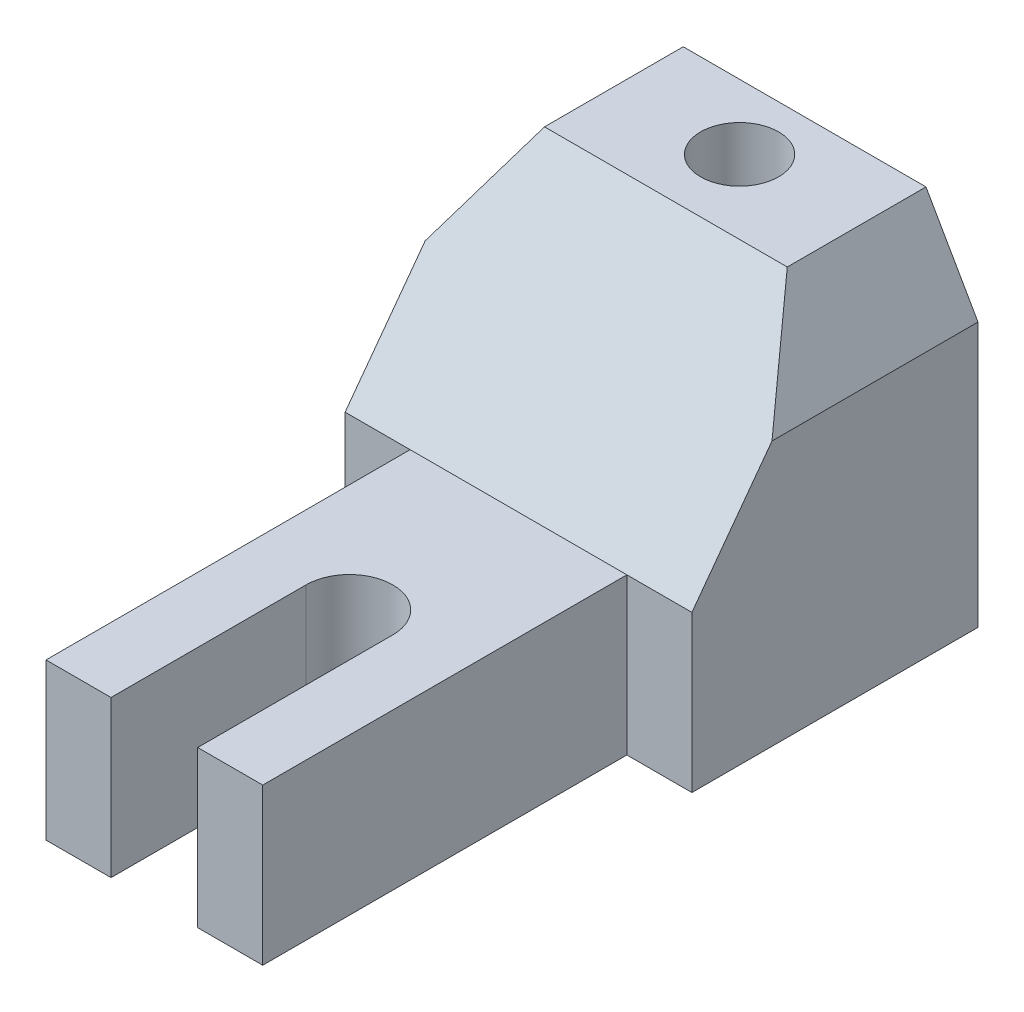
ISO-10303-21;
HEADER;
FILE_DESCRIPTION(('STEP AP214'),'2;1');
FILE_NAME('part.step','',(''),(''),'','','');
FILE_SCHEMA(('AUTOMOTIVE_DESIGN { 1 0 10303 214 1 1 1 1 }'));
ENDSEC;
DATA;
#1=APPLICATION_CONTEXT('core data for automotive mechanical design processes');
#2=APPLICATION_PROTOCOL_DEFINITION('international standard','automotive_design',2000,#1);
#3=PRODUCT_CONTEXT('',#1,'mechanical');
#4=PRODUCT('Part','Part','',(#3));
#5=PRODUCT_RELATED_PRODUCT_CATEGORY('part','',(#4));
#6=PRODUCT_DEFINITION_FORMATION('','',#4);
#7=PRODUCT_DEFINITION_CONTEXT('part definition',#1,'design');
#8=PRODUCT_DEFINITION('design','',#6,#7);
#9=PRODUCT_DEFINITION_SHAPE('','',#8);
#10=(LENGTH_UNIT() NAMED_UNIT(*) SI_UNIT(.MILLI.,.METRE.));
#11=(NAMED_UNIT(*) PLANE_ANGLE_UNIT() SI_UNIT($,.RADIAN.));
#12=(NAMED_UNIT(*) SI_UNIT($,.STERADIAN.) SOLID_ANGLE_UNIT());
#13=UNCERTAINTY_MEASURE_WITH_UNIT(LENGTH_MEASURE(1.E-05),#10,'distance_accuracy_value','');
#14=(GEOMETRIC_REPRESENTATION_CONTEXT(3) GLOBAL_UNCERTAINTY_ASSIGNED_CONTEXT((#13)) GLOBAL_UNIT_ASSIGNED_CONTEXT((#10,
#11,#12)) REPRESENTATION_CONTEXT('',''));
#15=CARTESIAN_POINT('',(0.,0.,0.));
#16=DIRECTION('',(0.,0.,1.));
#17=DIRECTION('',(1.,0.,0.));
#18=AXIS2_PLACEMENT_3D('',#15,#16,#17);
#19=CARTESIAN_POINT('',(18.7623762376237,82.,27.6608910891089));
#20=DIRECTION('',(1.,0.,0.));
#21=DIRECTION('',(0.,0.,-1.));
#22=AXIS2_PLACEMENT_3D('',#19,#20,#21);
#23=PLANE('',#22);
#24=DIRECTION('',(0.,1.,0.));
#25=VECTOR('',#24,1.);
#26=CARTESIAN_POINT('',(18.7623762376237,-68.,-56.3391089108911));
#27=LINE('',#26,#25);
#28=CARTESIAN_POINT('',(18.7623762376237,0.,-56.3391089108911));
#29=VERTEX_POINT('',#28);
#30=CARTESIAN_POINT('',(18.7623762376237,36.,-56.3391089108911));
#31=VERTEX_POINT('',#30);
#32=EDGE_CURVE('E211',#29,#31,#27,.T.);
#33=ORIENTED_EDGE('',*,*,#32,.T.);
#34=DIRECTION('',(0.,0.804176141466326,-0.594391061083806));
#35=VECTOR('',#34,1.);
#36=CARTESIAN_POINT('',(18.7623762376237,36.,-56.3391089108911));
#37=LINE('',#36,#35);
#38=CARTESIAN_POINT('',(18.7623762376237,61.,-74.8173697804563));
#39=VERTEX_POINT('',#38);
#40=EDGE_CURVE('E193',#31,#39,#37,.T.);
#41=ORIENTED_EDGE('',*,*,#40,.T.);
#42=DIRECTION('',(0.,0.,-1.));
#43=VECTOR('',#42,1.);
#44=CARTESIAN_POINT('',(18.7623762376237,61.,27.6608910891089));
#45=LINE('',#44,#43);
#46=CARTESIAN_POINT('',(18.7623762376237,61.,-122.339108910891));
#47=VERTEX_POINT('',#46);
#48=EDGE_CURVE('E255',#39,#47,#45,.T.);
#49=ORIENTED_EDGE('',*,*,#48,.T.);
#50=DIRECTION('',(0.,-1.,0.));
#51=VECTOR('',#50,1.);
#52=CARTESIAN_POINT('',(18.7623762376237,82.,-122.339108910891));
#53=LINE('',#52,#51);
#54=CARTESIAN_POINT('',(18.7623762376237,0.,-122.339108910891));
#55=VERTEX_POINT('',#54);
#56=EDGE_CURVE('E274',#47,#55,#53,.T.);
#57=ORIENTED_EDGE('',*,*,#56,.T.);
#58=DIRECTION('',(0.,0.,1.));
#59=VECTOR('',#58,1.);
#60=CARTESIAN_POINT('',(18.7623762376237,0.,27.6608910891089));
#61=LINE('',#60,#59);
#62=EDGE_CURVE('E222',#55,#29,#61,.T.);
#63=ORIENTED_EDGE('',*,*,#62,.T.);
#64=EDGE_LOOP('',(#33,#41,#49,#57,#63));
#65=FACE_BOUND('',#64,.T.);
#66=ADVANCED_FACE('F87',(#65),#23,.F.);
#67=CARTESIAN_POINT('',(18.7623762376237,82.,27.6608910891089));
#68=DIRECTION('',(0.,0.,-1.));
#69=DIRECTION('',(-1.,0.,0.));
#70=AXIS2_PLACEMENT_3D('',#67,#68,#69);
#71=PLANE('',#70);
#72=DIRECTION('',(0.,1.,0.));
#73=VECTOR('',#72,1.);
#74=CARTESIAN_POINT('',(83.7623762376238,-68.,27.6608910891089));
#75=LINE('',#74,#73);
#76=CARTESIAN_POINT('',(83.7623762376238,0.,27.6608910891089));
#77=VERTEX_POINT('',#76);
#78=CARTESIAN_POINT('',(83.7623762376238,36.,27.6608910891089));
#79=VERTEX_POINT('',#78);
#80=EDGE_CURVE('E238',#77,#79,#75,.T.);
#81=ORIENTED_EDGE('',*,*,#80,.T.);
#82=DIRECTION('',(1.,0.,0.));
#83=VECTOR('',#82,1.);
#84=CARTESIAN_POINT('',(18.7623762376237,36.,27.6608910891089));
#85=LINE('',#84,#83);
#86=CARTESIAN_POINT('',(68.7623762376237,36.,27.6608910891089));
#87=VERTEX_POINT('',#86);
#88=EDGE_CURVE('E205',#87,#79,#85,.T.);
#89=ORIENTED_EDGE('',*,*,#88,.F.);
#90=DIRECTION('',(0.,1.,0.));
#91=VECTOR('',#90,1.);
#92=CARTESIAN_POINT('',(68.7623762376237,-68.,27.6608910891089));
#93=LINE('',#92,#91);
#94=CARTESIAN_POINT('',(68.7623762376237,0.,27.6608910891089));
#95=VERTEX_POINT('',#94);
#96=EDGE_CURVE('E332',#95,#87,#93,.T.);
#97=ORIENTED_EDGE('',*,*,#96,.F.);
#98=DIRECTION('',(1.,0.,0.));
#99=VECTOR('',#98,1.);
#100=CARTESIAN_POINT('',(18.7623762376237,0.,27.6608910891089));
#101=LINE('',#100,#99);
#102=EDGE_CURVE('E278',#95,#77,#101,.T.);
#103=ORIENTED_EDGE('',*,*,#102,.T.);
#104=EDGE_LOOP('',(#81,#89,#97,#103));
#105=FACE_BOUND('',#104,.T.);
#106=ADVANCED_FACE('F329',(#105),#71,.F.);
#107=DIRECTION('',(0.,1.,0.));
#108=VECTOR('',#107,1.);
#109=CARTESIAN_POINT('',(48.7623762376237,-68.,27.6608910891089));
#110=LINE('',#109,#108);
#111=CARTESIAN_POINT('',(48.7623762376237,0.,27.6608910891089));
#112=VERTEX_POINT('',#111);
#113=CARTESIAN_POINT('',(48.7623762376237,36.,27.6608910891089));
#114=VERTEX_POINT('',#113);
#115=EDGE_CURVE('E336',#112,#114,#110,.T.);
#116=ORIENTED_EDGE('',*,*,#115,.T.);
#117=CARTESIAN_POINT('',(33.7623762376237,36.,27.6608910891089));
#118=VERTEX_POINT('',#117);
#119=EDGE_CURVE('E372',#118,#114,#85,.T.);
#120=ORIENTED_EDGE('',*,*,#119,.F.);
#121=DIRECTION('',(0.,1.,0.));
#122=VECTOR('',#121,1.);
#123=CARTESIAN_POINT('',(33.7623762376237,-68.,27.6608910891089));
#124=LINE('',#123,#122);
#125=CARTESIAN_POINT('',(33.7623762376237,0.,27.6608910891089));
#126=VERTEX_POINT('',#125);
#127=EDGE_CURVE('E228',#126,#118,#124,.T.);
#128=ORIENTED_EDGE('',*,*,#127,.F.);
#129=EDGE_CURVE('E282',#126,#112,#101,.T.);
#130=ORIENTED_EDGE('',*,*,#129,.T.);
#131=EDGE_LOOP('',(#116,#120,#128,#130));
#132=FACE_BOUND('',#131,.T.);
#133=ADVANCED_FACE('F402',(#132),#71,.F.);
#134=CARTESIAN_POINT('',(0.,82.,0.));
#135=DIRECTION('',(0.,-1.,0.));
#136=DIRECTION('',(0.,0.,-1.));
#137=AXIS2_PLACEMENT_3D('',#134,#135,#136);
#138=PLANE('',#137);
#139=CARTESIAN_POINT('',(58.7623762376237,82.,-107.339108910891));
#140=DIRECTION('',(0.,1.,0.));
#141=DIRECTION('',(0.,0.,1.));
#142=AXIS2_PLACEMENT_3D('',#139,#140,#141);
#143=CIRCLE('',#142,9.00000000000001);
#144=CARTESIAN_POINT('',(58.7623762376237,82.,-98.3391089108911));
#145=VERTEX_POINT('',#144);
#146=EDGE_CURVE('E246',#145,#145,#143,.T.);
#147=ORIENTED_EDGE('',*,*,#146,.F.);
#148=EDGE_LOOP('',(#147));
#149=FACE_BOUND('',#148,.T.);
#150=DIRECTION('',(0.,0.,-1.));
#151=VECTOR('',#150,1.);
#152=CARTESIAN_POINT('',(30.7623762376237,82.,27.6608910891089));
#153=LINE('',#152,#151);
#154=CARTESIAN_POINT('',(30.7623762376237,82.,-90.3391089108911));
#155=VERTEX_POINT('',#154);
#156=CARTESIAN_POINT('',(30.7623762376237,82.,-122.339108910891));
#157=VERTEX_POINT('',#156);
#158=EDGE_CURVE('E265',#155,#157,#153,.T.);
#159=ORIENTED_EDGE('',*,*,#158,.F.);
#160=DIRECTION('',(1.,0.,0.));
#161=VECTOR('',#160,1.);
#162=CARTESIAN_POINT('',(18.7623762376237,82.,-90.3391089108911));
#163=LINE('',#162,#161);
#164=CARTESIAN_POINT('',(86.7623762376237,82.,-90.3391089108911));
#165=VERTEX_POINT('',#164);
#166=EDGE_CURVE('E216',#155,#165,#163,.T.);
#167=ORIENTED_EDGE('',*,*,#166,.T.);
#168=DIRECTION('',(0.,0.,-1.));
#169=VECTOR('',#168,1.);
#170=CARTESIAN_POINT('',(86.7623762376237,82.,27.6608910891089));
#171=LINE('',#170,#169);
#172=CARTESIAN_POINT('',(86.7623762376237,82.,-122.339108910891));
#173=VERTEX_POINT('',#172);
#174=EDGE_CURVE('E256',#165,#173,#171,.T.);
#175=ORIENTED_EDGE('',*,*,#174,.T.);
#176=DIRECTION('',(-1.,0.,0.));
#177=VECTOR('',#176,1.);
#178=CARTESIAN_POINT('',(18.7623762376237,82.,-122.339108910891));
#179=LINE('',#178,#177);
#180=EDGE_CURVE('E270',#173,#157,#179,.T.);
#181=ORIENTED_EDGE('',*,*,#180,.T.);
#182=EDGE_LOOP('',(#159,#167,#175,#181));
#183=FACE_BOUND('',#182,.T.);
#184=ADVANCED_FACE('F321',(#149,#183),#138,.F.);
#185=CARTESIAN_POINT('',(0.,0.,0.));
#186=DIRECTION('',(0.,-1.,0.));
#187=DIRECTION('',(0.,0.,-1.));
#188=AXIS2_PLACEMENT_3D('',#185,#186,#187);
#189=PLANE('',#188);
#190=CARTESIAN_POINT('',(58.7623762376237,0.,-107.339108910891));
#191=DIRECTION('',(0.,-1.,0.));
#192=DIRECTION('',(0.,0.,-1.));
#193=AXIS2_PLACEMENT_3D('',#190,#191,#192);
#194=CIRCLE('',#193,9.00000000000001);
#195=CARTESIAN_POINT('',(58.7623762376237,0.,-116.339108910891));
#196=VERTEX_POINT('',#195);
#197=EDGE_CURVE('E249',#196,#196,#194,.T.);
#198=ORIENTED_EDGE('',*,*,#197,.F.);
#199=EDGE_LOOP('',(#198));
#200=FACE_BOUND('',#199,.T.);
#201=ORIENTED_EDGE('',*,*,#102,.F.);
#202=DIRECTION('',(0.,0.,-1.));
#203=VECTOR('',#202,1.);
#204=CARTESIAN_POINT('',(68.7623762376237,0.,0.));
#205=LINE('',#204,#203);
#206=CARTESIAN_POINT('',(68.7623762376237,0.,-17.3391089108911));
#207=VERTEX_POINT('',#206);
#208=EDGE_CURVE('E95',#95,#207,#205,.T.);
#209=ORIENTED_EDGE('',*,*,#208,.T.);
#210=CARTESIAN_POINT('',(58.7623762376237,0.,-17.3391089108911));
#211=DIRECTION('',(0.,-1.,0.));
#212=DIRECTION('',(0.,0.,-1.));
#213=AXIS2_PLACEMENT_3D('',#210,#211,#212);
#214=CIRCLE('',#213,10.);
#215=CARTESIAN_POINT('',(48.7623762376237,0.,-17.3391089108911));
#216=VERTEX_POINT('',#215);
#217=EDGE_CURVE('E302',#216,#207,#214,.T.);
#218=ORIENTED_EDGE('',*,*,#217,.F.);
#219=DIRECTION('',(0.,0.,-1.));
#220=VECTOR('',#219,1.);
#221=CARTESIAN_POINT('',(48.7623762376237,0.,0.));
#222=LINE('',#221,#220);
#223=EDGE_CURVE('E305',#112,#216,#222,.T.);
#224=ORIENTED_EDGE('',*,*,#223,.F.);
#225=ORIENTED_EDGE('',*,*,#129,.F.);
#226=DIRECTION('',(0.,0.,-1.));
#227=VECTOR('',#226,1.);
#228=CARTESIAN_POINT('',(33.7623762376237,0.,0.));
#229=LINE('',#228,#227);
#230=CARTESIAN_POINT('',(33.7623762376237,0.,-56.3391089108911));
#231=VERTEX_POINT('',#230);
#232=EDGE_CURVE('E298',#126,#231,#229,.T.);
#233=ORIENTED_EDGE('',*,*,#232,.T.);
#234=DIRECTION('',(-1.,0.,0.));
#235=VECTOR('',#234,1.);
#236=CARTESIAN_POINT('',(0.,0.,-56.3391089108911));
#237=LINE('',#236,#235);
#238=EDGE_CURVE('E245',#231,#29,#237,.T.);
#239=ORIENTED_EDGE('',*,*,#238,.T.);
#240=ORIENTED_EDGE('',*,*,#62,.F.);
#241=DIRECTION('',(-1.,0.,0.));
#242=VECTOR('',#241,1.);
#243=CARTESIAN_POINT('',(18.7623762376237,0.,-122.339108910891));
#244=LINE('',#243,#242);
#245=CARTESIAN_POINT('',(98.7623762376237,0.,-122.339108910891));
#246=VERTEX_POINT('',#245);
#247=EDGE_CURVE('E275',#246,#55,#244,.T.);
#248=ORIENTED_EDGE('',*,*,#247,.F.);
#249=DIRECTION('',(0.,0.,-1.));
#250=VECTOR('',#249,1.);
#251=CARTESIAN_POINT('',(98.7623762376237,0.,27.6608910891089));
#252=LINE('',#251,#250);
#253=CARTESIAN_POINT('',(98.7623762376237,0.,-56.3391089108911));
#254=VERTEX_POINT('',#253);
#255=EDGE_CURVE('E283',#254,#246,#252,.T.);
#256=ORIENTED_EDGE('',*,*,#255,.F.);
#257=DIRECTION('',(1.,0.,0.));
#258=VECTOR('',#257,1.);
#259=CARTESIAN_POINT('',(0.,0.,-56.3391089108911));
#260=LINE('',#259,#258);
#261=CARTESIAN_POINT('',(83.7623762376237,0.,-56.3391089108911));
#262=VERTEX_POINT('',#261);
#263=EDGE_CURVE('E242',#262,#254,#260,.T.);
#264=ORIENTED_EDGE('',*,*,#263,.F.);
#265=DIRECTION('',(0.,0.,-1.));
#266=VECTOR('',#265,1.);
#267=CARTESIAN_POINT('',(83.7623762376238,0.,0.));
#268=LINE('',#267,#266);
#269=EDGE_CURVE('E295',#77,#262,#268,.T.);
#270=ORIENTED_EDGE('',*,*,#269,.F.);
#271=EDGE_LOOP('',(#201,#209,#218,#224,#225,#233,#239,#240,#248,#256,#264,#270));
#272=FACE_BOUND('',#271,.T.);
#273=ADVANCED_FACE('F317',(#200,#272),#189,.T.);
#274=CARTESIAN_POINT('',(30.7623762376237,82.,27.6608910891089));
#275=DIRECTION('',(0.868243142124459,-0.496138938356834,0.));
#276=DIRECTION('',(0.496138938356834,0.868243142124459,0.));
#277=AXIS2_PLACEMENT_3D('',#274,#275,#276);
#278=PLANE('',#277);
#279=ORIENTED_EDGE('',*,*,#48,.F.);
#280=DIRECTION('',(0.417552512787548,0.730716897378209,-0.540095098062154));
#281=VECTOR('',#280,1.);
#282=CARTESIAN_POINT('',(4.15124452749314,35.4305195072715,-55.9181885467004));
#283=LINE('',#282,#281);
#284=EDGE_CURVE('E200',#39,#155,#283,.T.);
#285=ORIENTED_EDGE('',*,*,#284,.T.);
#286=ORIENTED_EDGE('',*,*,#158,.T.);
#287=DIRECTION('',(-0.496138938356834,-0.868243142124459,0.));
#288=VECTOR('',#287,1.);
#289=CARTESIAN_POINT('',(30.7623762376237,82.,-122.339108910891));
#290=LINE('',#289,#288);
#291=EDGE_CURVE('E261',#157,#47,#290,.T.);
#292=ORIENTED_EDGE('',*,*,#291,.T.);
#293=EDGE_LOOP('',(#279,#285,#286,#292));
#294=FACE_BOUND('',#293,.T.);
#295=ADVANCED_FACE('F320',(#294),#278,.F.);
#296=CARTESIAN_POINT('',(98.7623762376237,82.,27.6608910891089));
#297=DIRECTION('',(-1.,0.,0.));
#298=DIRECTION('',(0.,0.,1.));
#299=AXIS2_PLACEMENT_3D('',#296,#297,#298);
#300=PLANE('',#299);
#301=DIRECTION('',(0.,0.,-1.));
#302=VECTOR('',#301,1.);
#303=CARTESIAN_POINT('',(98.7623762376237,61.,27.6608910891089));
#304=LINE('',#303,#302);
#305=CARTESIAN_POINT('',(98.7623762376237,61.,-74.8173697804563));
#306=VERTEX_POINT('',#305);
#307=CARTESIAN_POINT('',(98.7623762376237,61.,-122.339108910891));
#308=VERTEX_POINT('',#307);
#309=EDGE_CURVE('E254',#306,#308,#304,.T.);
#310=ORIENTED_EDGE('',*,*,#309,.F.);
#311=DIRECTION('',(0.,0.804176141466326,-0.594391061083806));
#312=VECTOR('',#311,1.);
#313=CARTESIAN_POINT('',(98.7623762376237,36.,-56.3391089108911));
#314=LINE('',#313,#312);
#315=CARTESIAN_POINT('',(98.7623762376237,36.,-56.3391089108911));
#316=VERTEX_POINT('',#315);
#317=EDGE_CURVE('E206',#316,#306,#314,.T.);
#318=ORIENTED_EDGE('',*,*,#317,.F.);
#319=DIRECTION('',(0.,1.,0.));
#320=VECTOR('',#319,1.);
#321=CARTESIAN_POINT('',(98.7623762376237,-68.,-56.3391089108911));
#322=LINE('',#321,#320);
#323=EDGE_CURVE('E224',#254,#316,#322,.T.);
#324=ORIENTED_EDGE('',*,*,#323,.F.);
#325=ORIENTED_EDGE('',*,*,#255,.T.);
#326=DIRECTION('',(0.,-1.,0.));
#327=VECTOR('',#326,1.);
#328=CARTESIAN_POINT('',(98.7623762376237,82.,-122.339108910891));
#329=LINE('',#328,#327);
#330=EDGE_CURVE('E291',#308,#246,#329,.T.);
#331=ORIENTED_EDGE('',*,*,#330,.F.);
#332=EDGE_LOOP('',(#310,#318,#324,#325,#331));
#333=FACE_BOUND('',#332,.T.);
#334=ADVANCED_FACE('F388',(#333),#300,.F.);
#335=CARTESIAN_POINT('',(18.7623762376237,82.,-122.339108910891));
#336=DIRECTION('',(0.,0.,1.));
#337=DIRECTION('',(1.,0.,0.));
#338=AXIS2_PLACEMENT_3D('',#335,#336,#337);
#339=PLANE('',#338);
#340=ORIENTED_EDGE('',*,*,#180,.F.);
#341=DIRECTION('',(-0.496138938356834,0.868243142124459,0.));
#342=VECTOR('',#341,1.);
#343=CARTESIAN_POINT('',(98.7623762376237,61.,-122.339108910891));
#344=LINE('',#343,#342);
#345=EDGE_CURVE('E250',#308,#173,#344,.T.);
#346=ORIENTED_EDGE('',*,*,#345,.F.);
#347=ORIENTED_EDGE('',*,*,#330,.T.);
#348=ORIENTED_EDGE('',*,*,#247,.T.);
#349=ORIENTED_EDGE('',*,*,#56,.F.);
#350=ORIENTED_EDGE('',*,*,#291,.F.);
#351=EDGE_LOOP('',(#340,#346,#347,#348,#349,#350));
#352=FACE_BOUND('',#351,.T.);
#353=ADVANCED_FACE('F393',(#352),#339,.F.);
#354=CARTESIAN_POINT('',(98.7623762376237,61.,27.6608910891089));
#355=DIRECTION('',(-0.868243142124459,-0.496138938356834,0.));
#356=DIRECTION('',(0.496138938356834,-0.868243142124459,0.));
#357=AXIS2_PLACEMENT_3D('',#354,#355,#356);
#358=PLANE('',#357);
#359=ORIENTED_EDGE('',*,*,#174,.F.);
#360=DIRECTION('',(0.417552512787548,-0.730716897378209,0.540095098062154));
#361=VECTOR('',#360,1.);
#362=CARTESIAN_POINT('',(121.873075368345,20.5562765212376,-44.9241828613711));
#363=LINE('',#362,#361);
#364=EDGE_CURVE('E355',#165,#306,#363,.T.);
#365=ORIENTED_EDGE('',*,*,#364,.T.);
#366=ORIENTED_EDGE('',*,*,#309,.T.);
#367=ORIENTED_EDGE('',*,*,#345,.T.);
#368=EDGE_LOOP('',(#359,#365,#366,#367));
#369=FACE_BOUND('',#368,.T.);
#370=ADVANCED_FACE('F385',(#369),#358,.F.);
#371=CARTESIAN_POINT('',(0.,-68.,-56.3391089108911));
#372=DIRECTION('',(0.,0.,-1.));
#373=DIRECTION('',(-1.,0.,0.));
#374=AXIS2_PLACEMENT_3D('',#371,#372,#373);
#375=PLANE('',#374);
#376=ORIENTED_EDGE('',*,*,#323,.T.);
#377=DIRECTION('',(1.,0.,0.));
#378=VECTOR('',#377,1.);
#379=CARTESIAN_POINT('',(18.7623762376237,36.,-56.3391089108911));
#380=LINE('',#379,#378);
#381=CARTESIAN_POINT('',(83.7623762376238,36.,-56.3391089108911));
#382=VERTEX_POINT('',#381);
#383=EDGE_CURVE('E219',#382,#316,#380,.T.);
#384=ORIENTED_EDGE('',*,*,#383,.F.);
#385=DIRECTION('',(0.,1.,0.));
#386=VECTOR('',#385,1.);
#387=CARTESIAN_POINT('',(83.7623762376237,-68.,-56.3391089108911));
#388=LINE('',#387,#386);
#389=EDGE_CURVE('E231',#262,#382,#388,.T.);
#390=ORIENTED_EDGE('',*,*,#389,.F.);
#391=ORIENTED_EDGE('',*,*,#263,.T.);
#392=EDGE_LOOP('',(#376,#384,#390,#391));
#393=FACE_BOUND('',#392,.T.);
#394=ADVANCED_FACE('F409',(#393),#375,.F.);
#395=CARTESIAN_POINT('',(83.7623762376238,-68.,0.));
#396=DIRECTION('',(-1.,0.,0.));
#397=DIRECTION('',(0.,0.,1.));
#398=AXIS2_PLACEMENT_3D('',#395,#396,#397);
#399=PLANE('',#398);
#400=ORIENTED_EDGE('',*,*,#389,.T.);
#401=DIRECTION('',(0.,0.,1.));
#402=VECTOR('',#401,1.);
#403=CARTESIAN_POINT('',(83.7623762376238,36.,0.));
#404=LINE('',#403,#402);
#405=EDGE_CURVE('E359',#382,#79,#404,.T.);
#406=ORIENTED_EDGE('',*,*,#405,.T.);
#407=ORIENTED_EDGE('',*,*,#80,.F.);
#408=ORIENTED_EDGE('',*,*,#269,.T.);
#409=EDGE_LOOP('',(#400,#406,#407,#408));
#410=FACE_BOUND('',#409,.T.);
#411=ADVANCED_FACE('F411',(#410),#399,.F.);
#412=CARTESIAN_POINT('',(0.,-68.,-56.3391089108911));
#413=DIRECTION('',(0.,0.,1.));
#414=DIRECTION('',(1.,0.,0.));
#415=AXIS2_PLACEMENT_3D('',#412,#413,#414);
#416=PLANE('',#415);
#417=CARTESIAN_POINT('',(33.7623762376237,36.,-56.3391089108911));
#418=VERTEX_POINT('',#417);
#419=EDGE_CURVE('E197',#31,#418,#380,.T.);
#420=ORIENTED_EDGE('',*,*,#419,.F.);
#421=ORIENTED_EDGE('',*,*,#32,.F.);
#422=ORIENTED_EDGE('',*,*,#238,.F.);
#423=DIRECTION('',(0.,1.,0.));
#424=VECTOR('',#423,1.);
#425=CARTESIAN_POINT('',(33.7623762376237,-68.,-56.3391089108911));
#426=LINE('',#425,#424);
#427=EDGE_CURVE('E214',#231,#418,#426,.T.);
#428=ORIENTED_EDGE('',*,*,#427,.T.);
#429=EDGE_LOOP('',(#420,#421,#422,#428));
#430=FACE_BOUND('',#429,.T.);
#431=ADVANCED_FACE('F210',(#430),#416,.T.);
#432=CARTESIAN_POINT('',(33.7623762376237,-68.,0.));
#433=DIRECTION('',(-1.,0.,0.));
#434=DIRECTION('',(0.,0.,1.));
#435=AXIS2_PLACEMENT_3D('',#432,#433,#434);
#436=PLANE('',#435);
#437=DIRECTION('',(0.,0.,1.));
#438=VECTOR('',#437,1.);
#439=CARTESIAN_POINT('',(33.7623762376237,36.,0.));
#440=LINE('',#439,#438);
#441=EDGE_CURVE('E363',#418,#118,#440,.T.);
#442=ORIENTED_EDGE('',*,*,#441,.F.);
#443=ORIENTED_EDGE('',*,*,#427,.F.);
#444=ORIENTED_EDGE('',*,*,#232,.F.);
#445=ORIENTED_EDGE('',*,*,#127,.T.);
#446=EDGE_LOOP('',(#442,#443,#444,#445));
#447=FACE_BOUND('',#446,.T.);
#448=ADVANCED_FACE('F397',(#447),#436,.T.);
#449=CARTESIAN_POINT('',(68.7623762376237,-68.,0.));
#450=DIRECTION('',(-1.,0.,0.));
#451=DIRECTION('',(0.,0.,1.));
#452=AXIS2_PLACEMENT_3D('',#449,#450,#451);
#453=PLANE('',#452);
#454=DIRECTION('',(0.,0.,1.));
#455=VECTOR('',#454,1.);
#456=CARTESIAN_POINT('',(68.7623762376237,36.,0.));
#457=LINE('',#456,#455);
#458=CARTESIAN_POINT('',(68.7623762376237,36.,-17.3391089108911));
#459=VERTEX_POINT('',#458);
#460=EDGE_CURVE('E366',#459,#87,#457,.T.);
#461=ORIENTED_EDGE('',*,*,#460,.F.);
#462=DIRECTION('',(0.,1.,0.));
#463=VECTOR('',#462,1.);
#464=CARTESIAN_POINT('',(68.7623762376237,-68.,-17.3391089108911));
#465=LINE('',#464,#463);
#466=EDGE_CURVE('E346',#207,#459,#465,.T.);
#467=ORIENTED_EDGE('',*,*,#466,.F.);
#468=ORIENTED_EDGE('',*,*,#208,.F.);
#469=ORIENTED_EDGE('',*,*,#96,.T.);
#470=EDGE_LOOP('',(#461,#467,#468,#469));
#471=FACE_BOUND('',#470,.T.);
#472=ADVANCED_FACE('F413',(#471),#453,.T.);
#473=CARTESIAN_POINT('',(48.7623762376237,-68.,0.));
#474=DIRECTION('',(-1.,0.,0.));
#475=DIRECTION('',(0.,0.,1.));
#476=AXIS2_PLACEMENT_3D('',#473,#474,#475);
#477=PLANE('',#476);
#478=DIRECTION('',(0.,1.,0.));
#479=VECTOR('',#478,1.);
#480=CARTESIAN_POINT('',(48.7623762376237,-68.,-17.3391089108911));
#481=LINE('',#480,#479);
#482=CARTESIAN_POINT('',(48.7623762376237,36.,-17.3391089108911));
#483=VERTEX_POINT('',#482);
#484=EDGE_CURVE('E108',#216,#483,#481,.T.);
#485=ORIENTED_EDGE('',*,*,#484,.T.);
#486=DIRECTION('',(0.,0.,1.));
#487=VECTOR('',#486,1.);
#488=CARTESIAN_POINT('',(48.7623762376237,36.,0.));
#489=LINE('',#488,#487);
#490=EDGE_CURVE('E102',#483,#114,#489,.T.);
#491=ORIENTED_EDGE('',*,*,#490,.T.);
#492=ORIENTED_EDGE('',*,*,#115,.F.);
#493=ORIENTED_EDGE('',*,*,#223,.T.);
#494=EDGE_LOOP('',(#485,#491,#492,#493));
#495=FACE_BOUND('',#494,.T.);
#496=ADVANCED_FACE('F418',(#495),#477,.F.);
#497=CARTESIAN_POINT('',(58.7623762376237,-68.,-17.3391089108911));
#498=DIRECTION('',(0.,1.,0.));
#499=DIRECTION('',(0.,0.,1.));
#500=AXIS2_PLACEMENT_3D('',#497,#498,#499);
#501=CYLINDRICAL_SURFACE('',#500,10.);
#502=ORIENTED_EDGE('',*,*,#466,.T.);
#503=CARTESIAN_POINT('',(58.7623762376237,36.,-17.3391089108911));
#504=DIRECTION('',(0.,-1.,0.));
#505=DIRECTION('',(0.,0.,-1.));
#506=AXIS2_PLACEMENT_3D('',#503,#504,#505);
#507=CIRCLE('',#506,10.);
#508=EDGE_CURVE('E12',#459,#483,#507,.F.);
#509=ORIENTED_EDGE('',*,*,#508,.T.);
#510=ORIENTED_EDGE('',*,*,#484,.F.);
#511=ORIENTED_EDGE('',*,*,#217,.T.);
#512=EDGE_LOOP('',(#502,#509,#510,#511));
#513=FACE_BOUND('',#512,.T.);
#514=ADVANCED_FACE('F414',(#513),#501,.F.);
#515=CARTESIAN_POINT('',(58.7623762376237,-68.,-107.339108910891));
#516=DIRECTION('',(0.,1.,0.));
#517=DIRECTION('',(0.,0.,1.));
#518=AXIS2_PLACEMENT_3D('',#515,#516,#517);
#519=CYLINDRICAL_SURFACE('',#518,9.00000000000001);
#520=ORIENTED_EDGE('',*,*,#197,.T.);
#521=EDGE_LOOP('',(#520));
#522=FACE_BOUND('',#521,.T.);
#523=ORIENTED_EDGE('',*,*,#146,.T.);
#524=EDGE_LOOP('',(#523));
#525=FACE_BOUND('',#524,.T.);
#526=ADVANCED_FACE('F314',(#522,#525),#519,.F.);
#527=CARTESIAN_POINT('',(18.7623762376237,36.,-56.3391089108911));
#528=DIRECTION('',(0.,-0.594391061083806,-0.804176141466326));
#529=DIRECTION('',(0.,0.804176141466326,-0.594391061083806));
#530=AXIS2_PLACEMENT_3D('',#527,#528,#529);
#531=PLANE('',#530);
#532=ORIENTED_EDGE('',*,*,#40,.F.);
#533=ORIENTED_EDGE('',*,*,#419,.T.);
#534=EDGE_CURVE('E217',#418,#382,#380,.T.);
#535=ORIENTED_EDGE('',*,*,#534,.T.);
#536=ORIENTED_EDGE('',*,*,#383,.T.);
#537=ORIENTED_EDGE('',*,*,#317,.T.);
#538=ORIENTED_EDGE('',*,*,#364,.F.);
#539=ORIENTED_EDGE('',*,*,#166,.F.);
#540=ORIENTED_EDGE('',*,*,#284,.F.);
#541=EDGE_LOOP('',(#532,#533,#535,#536,#537,#538,#539,#540));
#542=FACE_BOUND('',#541,.T.);
#543=ADVANCED_FACE('F195',(#542),#531,.F.);
#544=CARTESIAN_POINT('',(18.7623762376237,36.,27.6608910891089));
#545=DIRECTION('',(0.,-1.,0.));
#546=DIRECTION('',(0.,0.,-1.));
#547=AXIS2_PLACEMENT_3D('',#544,#545,#546);
#548=PLANE('',#547);
#549=ORIENTED_EDGE('',*,*,#534,.F.);
#550=ORIENTED_EDGE('',*,*,#441,.T.);
#551=ORIENTED_EDGE('',*,*,#119,.T.);
#552=ORIENTED_EDGE('',*,*,#490,.F.);
#553=ORIENTED_EDGE('',*,*,#508,.F.);
#554=ORIENTED_EDGE('',*,*,#460,.T.);
#555=ORIENTED_EDGE('',*,*,#88,.T.);
#556=ORIENTED_EDGE('',*,*,#405,.F.);
#557=EDGE_LOOP('',(#549,#550,#551,#552,#553,#554,#555,#556));
#558=FACE_BOUND('',#557,.T.);
#559=ADVANCED_FACE('F400',(#558),#548,.F.);
#560=CLOSED_SHELL('',(#66,#106,#133,#184,#273,#295,#334,#353,#370,#394,#411,#431,#448,#472,#496,
#514,#526,#543,#559));
#561=MANIFOLD_SOLID_BREP('B2',#560);
#562=ADVANCED_BREP_SHAPE_REPRESENTATION('',(#18,#561),#14);
#563=SHAPE_DEFINITION_REPRESENTATION(#9,#562);
ENDSEC;
END-ISO-10303-21;
